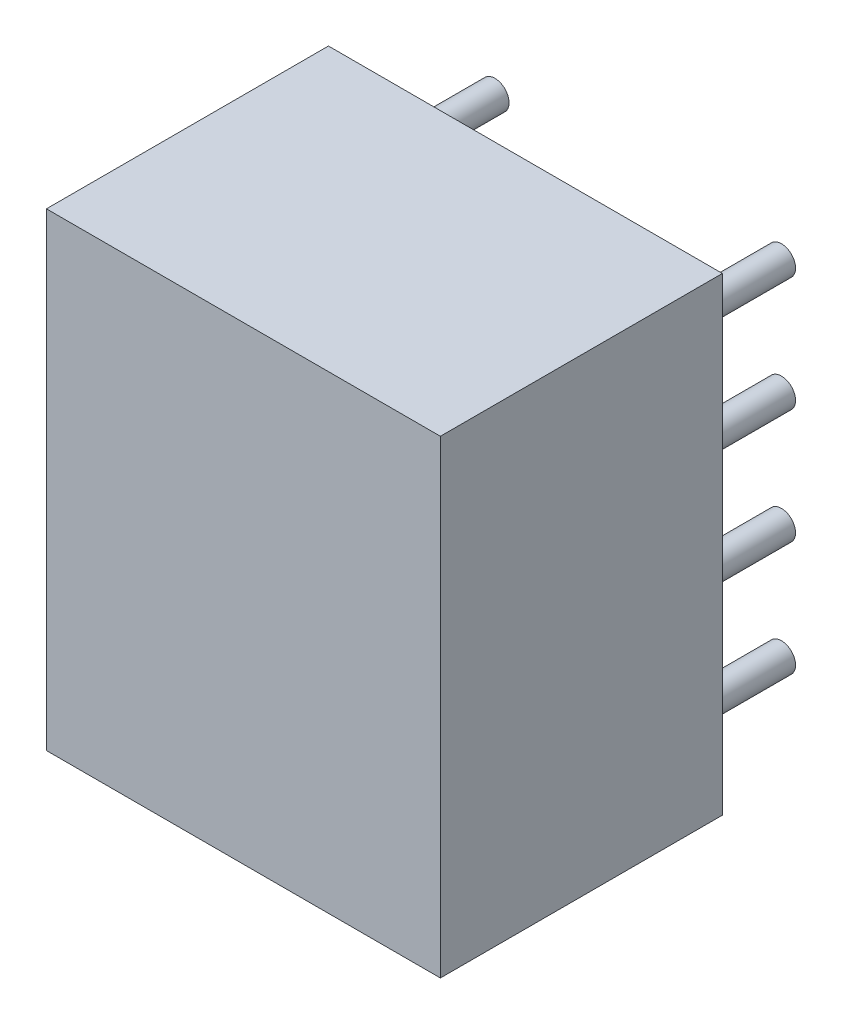
ISO-10303-21;
HEADER;
FILE_DESCRIPTION(('STEP AP214'),'2;1');
FILE_NAME('part.step','',(''),(''),'','','');
FILE_SCHEMA(('AUTOMOTIVE_DESIGN { 1 0 10303 214 1 1 1 1 }'));
ENDSEC;
DATA;
#1=APPLICATION_CONTEXT('core data for automotive mechanical design processes');
#2=APPLICATION_PROTOCOL_DEFINITION('international standard','automotive_design',2000,#1);
#3=PRODUCT_CONTEXT('',#1,'mechanical');
#4=PRODUCT('Part','Part','',(#3));
#5=PRODUCT_RELATED_PRODUCT_CATEGORY('part','',(#4));
#6=PRODUCT_DEFINITION_FORMATION('','',#4);
#7=PRODUCT_DEFINITION_CONTEXT('part definition',#1,'design');
#8=PRODUCT_DEFINITION('design','',#6,#7);
#9=PRODUCT_DEFINITION_SHAPE('','',#8);
#10=(LENGTH_UNIT() NAMED_UNIT(*) SI_UNIT(.MILLI.,.METRE.));
#11=(NAMED_UNIT(*) PLANE_ANGLE_UNIT() SI_UNIT($,.RADIAN.));
#12=(NAMED_UNIT(*) SI_UNIT($,.STERADIAN.) SOLID_ANGLE_UNIT());
#13=UNCERTAINTY_MEASURE_WITH_UNIT(LENGTH_MEASURE(1.E-05),#10,'distance_accuracy_value','');
#14=(GEOMETRIC_REPRESENTATION_CONTEXT(3) GLOBAL_UNCERTAINTY_ASSIGNED_CONTEXT((#13)) GLOBAL_UNIT_ASSIGNED_CONTEXT((#10,
#11,#12)) REPRESENTATION_CONTEXT('',''));
#15=CARTESIAN_POINT('',(0.,0.,0.));
#16=DIRECTION('',(0.,0.,1.));
#17=DIRECTION('',(1.,0.,0.));
#18=AXIS2_PLACEMENT_3D('',#15,#16,#17);
#19=CARTESIAN_POINT('',(0.,6.096,-2.));
#20=DIRECTION('',(0.,0.,1.));
#21=DIRECTION('',(1.,0.,0.));
#22=AXIS2_PLACEMENT_3D('',#19,#20,#21);
#23=CYLINDRICAL_SURFACE('',#22,0.25);
#24=CARTESIAN_POINT('',(0.,6.096,-2.));
#25=DIRECTION('',(0.,0.,1.));
#26=DIRECTION('',(1.,0.,0.));
#27=AXIS2_PLACEMENT_3D('',#24,#25,#26);
#28=CIRCLE('',#27,0.25);
#29=CARTESIAN_POINT('',(0.25,6.096,-2.));
#30=VERTEX_POINT('',#29);
#31=EDGE_CURVE('E11',#30,#30,#28,.T.);
#32=ORIENTED_EDGE('',*,*,#31,.T.);
#33=EDGE_LOOP('',(#32));
#34=FACE_BOUND('',#33,.T.);
#35=CARTESIAN_POINT('',(0.,6.096,0.));
#36=DIRECTION('',(0.,0.,1.));
#37=DIRECTION('',(1.,0.,0.));
#38=AXIS2_PLACEMENT_3D('',#35,#36,#37);
#39=CIRCLE('',#38,0.25);
#40=CARTESIAN_POINT('',(0.25,6.096,0.));
#41=VERTEX_POINT('',#40);
#42=EDGE_CURVE('E43',#41,#41,#39,.T.);
#43=ORIENTED_EDGE('',*,*,#42,.F.);
#44=EDGE_LOOP('',(#43));
#45=FACE_BOUND('',#44,.T.);
#46=ADVANCED_FACE('F40',(#34,#45),#23,.T.);
#47=CARTESIAN_POINT('',(0.,6.096,-2.));
#48=DIRECTION('',(0.,0.,1.));
#49=DIRECTION('',(1.,0.,0.));
#50=AXIS2_PLACEMENT_3D('',#47,#48,#49);
#51=PLANE('',#50);
#52=ORIENTED_EDGE('',*,*,#31,.F.);
#53=EDGE_LOOP('',(#52));
#54=FACE_BOUND('',#53,.T.);
#55=ADVANCED_FACE('F55',(#54),#51,.F.);
#56=CARTESIAN_POINT('',(0.,6.096,0.));
#57=DIRECTION('',(0.,0.,1.));
#58=DIRECTION('',(1.,0.,0.));
#59=AXIS2_PLACEMENT_3D('',#56,#57,#58);
#60=PLANE('',#59);
#61=ORIENTED_EDGE('',*,*,#42,.T.);
#62=EDGE_LOOP('',(#61));
#63=FACE_BOUND('',#62,.T.);
#64=ADVANCED_FACE('F52',(#63),#60,.T.);
#65=CLOSED_SHELL('',(#46,#55,#64));
#66=MANIFOLD_SOLID_BREP('B2',#65);
#67=CARTESIAN_POINT('',(0.,4.064,-2.));
#68=DIRECTION('',(0.,0.,1.));
#69=DIRECTION('',(1.,0.,0.));
#70=AXIS2_PLACEMENT_3D('',#67,#68,#69);
#71=CYLINDRICAL_SURFACE('',#70,0.25);
#72=CARTESIAN_POINT('',(0.,4.064,-2.));
#73=DIRECTION('',(0.,0.,1.));
#74=DIRECTION('',(1.,0.,0.));
#75=AXIS2_PLACEMENT_3D('',#72,#73,#74);
#76=CIRCLE('',#75,0.25);
#77=CARTESIAN_POINT('',(0.25,4.064,-2.));
#78=VERTEX_POINT('',#77);
#79=EDGE_CURVE('E39',#78,#78,#76,.T.);
#80=ORIENTED_EDGE('',*,*,#79,.T.);
#81=EDGE_LOOP('',(#80));
#82=FACE_BOUND('',#81,.T.);
#83=CARTESIAN_POINT('',(0.,4.064,0.));
#84=DIRECTION('',(0.,0.,1.));
#85=DIRECTION('',(1.,0.,0.));
#86=AXIS2_PLACEMENT_3D('',#83,#84,#85);
#87=CIRCLE('',#86,0.25);
#88=CARTESIAN_POINT('',(0.25,4.064,0.));
#89=VERTEX_POINT('',#88);
#90=EDGE_CURVE('E92',#89,#89,#87,.T.);
#91=ORIENTED_EDGE('',*,*,#90,.F.);
#92=EDGE_LOOP('',(#91));
#93=FACE_BOUND('',#92,.T.);
#94=ADVANCED_FACE('F89',(#82,#93),#71,.T.);
#95=CARTESIAN_POINT('',(0.,4.064,-2.));
#96=DIRECTION('',(0.,0.,1.));
#97=DIRECTION('',(1.,0.,0.));
#98=AXIS2_PLACEMENT_3D('',#95,#96,#97);
#99=PLANE('',#98);
#100=ORIENTED_EDGE('',*,*,#79,.F.);
#101=EDGE_LOOP('',(#100));
#102=FACE_BOUND('',#101,.T.);
#103=ADVANCED_FACE('F104',(#102),#99,.F.);
#104=CARTESIAN_POINT('',(0.,4.064,0.));
#105=DIRECTION('',(0.,0.,1.));
#106=DIRECTION('',(1.,0.,0.));
#107=AXIS2_PLACEMENT_3D('',#104,#105,#106);
#108=PLANE('',#107);
#109=ORIENTED_EDGE('',*,*,#90,.T.);
#110=EDGE_LOOP('',(#109));
#111=FACE_BOUND('',#110,.T.);
#112=ADVANCED_FACE('F101',(#111),#108,.T.);
#113=CLOSED_SHELL('',(#94,#103,#112));
#114=MANIFOLD_SOLID_BREP('B6',#113);
#115=CARTESIAN_POINT('',(0.,2.032,-2.));
#116=DIRECTION('',(0.,0.,1.));
#117=DIRECTION('',(1.,0.,0.));
#118=AXIS2_PLACEMENT_3D('',#115,#116,#117);
#119=CYLINDRICAL_SURFACE('',#118,0.25);
#120=CARTESIAN_POINT('',(0.,2.032,-2.));
#121=DIRECTION('',(0.,0.,1.));
#122=DIRECTION('',(1.,0.,0.));
#123=AXIS2_PLACEMENT_3D('',#120,#121,#122);
#124=CIRCLE('',#123,0.25);
#125=CARTESIAN_POINT('',(0.25,2.032,-2.));
#126=VERTEX_POINT('',#125);
#127=EDGE_CURVE('E88',#126,#126,#124,.T.);
#128=ORIENTED_EDGE('',*,*,#127,.T.);
#129=EDGE_LOOP('',(#128));
#130=FACE_BOUND('',#129,.T.);
#131=CARTESIAN_POINT('',(0.,2.032,0.));
#132=DIRECTION('',(0.,0.,1.));
#133=DIRECTION('',(1.,0.,0.));
#134=AXIS2_PLACEMENT_3D('',#131,#132,#133);
#135=CIRCLE('',#134,0.25);
#136=CARTESIAN_POINT('',(0.25,2.032,0.));
#137=VERTEX_POINT('',#136);
#138=EDGE_CURVE('E141',#137,#137,#135,.T.);
#139=ORIENTED_EDGE('',*,*,#138,.F.);
#140=EDGE_LOOP('',(#139));
#141=FACE_BOUND('',#140,.T.);
#142=ADVANCED_FACE('F138',(#130,#141),#119,.T.);
#143=CARTESIAN_POINT('',(0.,2.032,-2.));
#144=DIRECTION('',(0.,0.,1.));
#145=DIRECTION('',(1.,0.,0.));
#146=AXIS2_PLACEMENT_3D('',#143,#144,#145);
#147=PLANE('',#146);
#148=ORIENTED_EDGE('',*,*,#127,.F.);
#149=EDGE_LOOP('',(#148));
#150=FACE_BOUND('',#149,.T.);
#151=ADVANCED_FACE('F153',(#150),#147,.F.);
#152=CARTESIAN_POINT('',(0.,2.032,0.));
#153=DIRECTION('',(0.,0.,1.));
#154=DIRECTION('',(1.,0.,0.));
#155=AXIS2_PLACEMENT_3D('',#152,#153,#154);
#156=PLANE('',#155);
#157=ORIENTED_EDGE('',*,*,#138,.T.);
#158=EDGE_LOOP('',(#157));
#159=FACE_BOUND('',#158,.T.);
#160=ADVANCED_FACE('F150',(#159),#156,.T.);
#161=CLOSED_SHELL('',(#142,#151,#160));
#162=MANIFOLD_SOLID_BREP('B34',#161);
#163=CARTESIAN_POINT('',(0.,0.,-2.));
#164=DIRECTION('',(0.,0.,1.));
#165=DIRECTION('',(1.,0.,0.));
#166=AXIS2_PLACEMENT_3D('',#163,#164,#165);
#167=CYLINDRICAL_SURFACE('',#166,0.25);
#168=CARTESIAN_POINT('',(0.,0.,-2.));
#169=DIRECTION('',(0.,0.,1.));
#170=DIRECTION('',(1.,0.,0.));
#171=AXIS2_PLACEMENT_3D('',#168,#169,#170);
#172=CIRCLE('',#171,0.25);
#173=CARTESIAN_POINT('',(0.25,0.,-2.));
#174=VERTEX_POINT('',#173);
#175=EDGE_CURVE('E137',#174,#174,#172,.T.);
#176=ORIENTED_EDGE('',*,*,#175,.T.);
#177=EDGE_LOOP('',(#176));
#178=FACE_BOUND('',#177,.T.);
#179=CARTESIAN_POINT('',(0.,0.,0.));
#180=DIRECTION('',(0.,0.,1.));
#181=DIRECTION('',(1.,0.,0.));
#182=AXIS2_PLACEMENT_3D('',#179,#180,#181);
#183=CIRCLE('',#182,0.25);
#184=CARTESIAN_POINT('',(0.25,0.,0.));
#185=VERTEX_POINT('',#184);
#186=EDGE_CURVE('E190',#185,#185,#183,.T.);
#187=ORIENTED_EDGE('',*,*,#186,.F.);
#188=EDGE_LOOP('',(#187));
#189=FACE_BOUND('',#188,.T.);
#190=ADVANCED_FACE('F187',(#178,#189),#167,.T.);
#191=CARTESIAN_POINT('',(0.,0.,-2.));
#192=DIRECTION('',(0.,0.,1.));
#193=DIRECTION('',(1.,0.,0.));
#194=AXIS2_PLACEMENT_3D('',#191,#192,#193);
#195=PLANE('',#194);
#196=ORIENTED_EDGE('',*,*,#175,.F.);
#197=EDGE_LOOP('',(#196));
#198=FACE_BOUND('',#197,.T.);
#199=ADVANCED_FACE('F202',(#198),#195,.F.);
#200=CARTESIAN_POINT('',(0.,0.,0.));
#201=DIRECTION('',(0.,0.,1.));
#202=DIRECTION('',(1.,0.,0.));
#203=AXIS2_PLACEMENT_3D('',#200,#201,#202);
#204=PLANE('',#203);
#205=ORIENTED_EDGE('',*,*,#186,.T.);
#206=EDGE_LOOP('',(#205));
#207=FACE_BOUND('',#206,.T.);
#208=ADVANCED_FACE('F199',(#207),#204,.T.);
#209=CLOSED_SHELL('',(#190,#199,#208));
#210=MANIFOLD_SOLID_BREP('B83',#209);
#211=CARTESIAN_POINT('',(5.08,6.096,-2.));
#212=DIRECTION('',(0.,0.,1.));
#213=DIRECTION('',(1.,0.,0.));
#214=AXIS2_PLACEMENT_3D('',#211,#212,#213);
#215=CYLINDRICAL_SURFACE('',#214,0.25);
#216=CARTESIAN_POINT('',(5.08,6.096,-2.));
#217=DIRECTION('',(0.,0.,1.));
#218=DIRECTION('',(1.,0.,0.));
#219=AXIS2_PLACEMENT_3D('',#216,#217,#218);
#220=CIRCLE('',#219,0.25);
#221=CARTESIAN_POINT('',(5.33,6.096,-2.));
#222=VERTEX_POINT('',#221);
#223=EDGE_CURVE('E186',#222,#222,#220,.T.);
#224=ORIENTED_EDGE('',*,*,#223,.T.);
#225=EDGE_LOOP('',(#224));
#226=FACE_BOUND('',#225,.T.);
#227=CARTESIAN_POINT('',(5.08,6.096,0.));
#228=DIRECTION('',(0.,0.,1.));
#229=DIRECTION('',(1.,0.,0.));
#230=AXIS2_PLACEMENT_3D('',#227,#228,#229);
#231=CIRCLE('',#230,0.25);
#232=CARTESIAN_POINT('',(5.33,6.096,0.));
#233=VERTEX_POINT('',#232);
#234=EDGE_CURVE('E239',#233,#233,#231,.T.);
#235=ORIENTED_EDGE('',*,*,#234,.F.);
#236=EDGE_LOOP('',(#235));
#237=FACE_BOUND('',#236,.T.);
#238=ADVANCED_FACE('F236',(#226,#237),#215,.T.);
#239=CARTESIAN_POINT('',(5.08,6.096,-2.));
#240=DIRECTION('',(0.,0.,1.));
#241=DIRECTION('',(1.,0.,0.));
#242=AXIS2_PLACEMENT_3D('',#239,#240,#241);
#243=PLANE('',#242);
#244=ORIENTED_EDGE('',*,*,#223,.F.);
#245=EDGE_LOOP('',(#244));
#246=FACE_BOUND('',#245,.T.);
#247=ADVANCED_FACE('F251',(#246),#243,.F.);
#248=CARTESIAN_POINT('',(5.08,6.096,0.));
#249=DIRECTION('',(0.,0.,1.));
#250=DIRECTION('',(1.,0.,0.));
#251=AXIS2_PLACEMENT_3D('',#248,#249,#250);
#252=PLANE('',#251);
#253=ORIENTED_EDGE('',*,*,#234,.T.);
#254=EDGE_LOOP('',(#253));
#255=FACE_BOUND('',#254,.T.);
#256=ADVANCED_FACE('F248',(#255),#252,.T.);
#257=CLOSED_SHELL('',(#238,#247,#256));
#258=MANIFOLD_SOLID_BREP('B132',#257);
#259=CARTESIAN_POINT('',(5.08,4.064,-2.));
#260=DIRECTION('',(0.,0.,1.));
#261=DIRECTION('',(1.,0.,0.));
#262=AXIS2_PLACEMENT_3D('',#259,#260,#261);
#263=CYLINDRICAL_SURFACE('',#262,0.25);
#264=CARTESIAN_POINT('',(5.08,4.064,-2.));
#265=DIRECTION('',(0.,0.,1.));
#266=DIRECTION('',(1.,0.,0.));
#267=AXIS2_PLACEMENT_3D('',#264,#265,#266);
#268=CIRCLE('',#267,0.25);
#269=CARTESIAN_POINT('',(5.33,4.064,-2.));
#270=VERTEX_POINT('',#269);
#271=EDGE_CURVE('E235',#270,#270,#268,.T.);
#272=ORIENTED_EDGE('',*,*,#271,.T.);
#273=EDGE_LOOP('',(#272));
#274=FACE_BOUND('',#273,.T.);
#275=CARTESIAN_POINT('',(5.08,4.064,0.));
#276=DIRECTION('',(0.,0.,1.));
#277=DIRECTION('',(1.,0.,0.));
#278=AXIS2_PLACEMENT_3D('',#275,#276,#277);
#279=CIRCLE('',#278,0.25);
#280=CARTESIAN_POINT('',(5.33,4.064,0.));
#281=VERTEX_POINT('',#280);
#282=EDGE_CURVE('E288',#281,#281,#279,.T.);
#283=ORIENTED_EDGE('',*,*,#282,.F.);
#284=EDGE_LOOP('',(#283));
#285=FACE_BOUND('',#284,.T.);
#286=ADVANCED_FACE('F285',(#274,#285),#263,.T.);
#287=CARTESIAN_POINT('',(5.08,4.064,-2.));
#288=DIRECTION('',(0.,0.,1.));
#289=DIRECTION('',(1.,0.,0.));
#290=AXIS2_PLACEMENT_3D('',#287,#288,#289);
#291=PLANE('',#290);
#292=ORIENTED_EDGE('',*,*,#271,.F.);
#293=EDGE_LOOP('',(#292));
#294=FACE_BOUND('',#293,.T.);
#295=ADVANCED_FACE('F300',(#294),#291,.F.);
#296=CARTESIAN_POINT('',(5.08,4.064,0.));
#297=DIRECTION('',(0.,0.,1.));
#298=DIRECTION('',(1.,0.,0.));
#299=AXIS2_PLACEMENT_3D('',#296,#297,#298);
#300=PLANE('',#299);
#301=ORIENTED_EDGE('',*,*,#282,.T.);
#302=EDGE_LOOP('',(#301));
#303=FACE_BOUND('',#302,.T.);
#304=ADVANCED_FACE('F297',(#303),#300,.T.);
#305=CLOSED_SHELL('',(#286,#295,#304));
#306=MANIFOLD_SOLID_BREP('B181',#305);
#307=CARTESIAN_POINT('',(5.08,2.032,-2.));
#308=DIRECTION('',(0.,0.,1.));
#309=DIRECTION('',(1.,0.,0.));
#310=AXIS2_PLACEMENT_3D('',#307,#308,#309);
#311=CYLINDRICAL_SURFACE('',#310,0.25);
#312=CARTESIAN_POINT('',(5.08,2.032,-2.));
#313=DIRECTION('',(0.,0.,1.));
#314=DIRECTION('',(1.,0.,0.));
#315=AXIS2_PLACEMENT_3D('',#312,#313,#314);
#316=CIRCLE('',#315,0.25);
#317=CARTESIAN_POINT('',(5.33,2.032,-2.));
#318=VERTEX_POINT('',#317);
#319=EDGE_CURVE('E284',#318,#318,#316,.T.);
#320=ORIENTED_EDGE('',*,*,#319,.T.);
#321=EDGE_LOOP('',(#320));
#322=FACE_BOUND('',#321,.T.);
#323=CARTESIAN_POINT('',(5.08,2.032,0.));
#324=DIRECTION('',(0.,0.,1.));
#325=DIRECTION('',(1.,0.,0.));
#326=AXIS2_PLACEMENT_3D('',#323,#324,#325);
#327=CIRCLE('',#326,0.25);
#328=CARTESIAN_POINT('',(5.33,2.032,0.));
#329=VERTEX_POINT('',#328);
#330=EDGE_CURVE('E337',#329,#329,#327,.T.);
#331=ORIENTED_EDGE('',*,*,#330,.F.);
#332=EDGE_LOOP('',(#331));
#333=FACE_BOUND('',#332,.T.);
#334=ADVANCED_FACE('F334',(#322,#333),#311,.T.);
#335=CARTESIAN_POINT('',(5.08,2.032,-2.));
#336=DIRECTION('',(0.,0.,1.));
#337=DIRECTION('',(1.,0.,0.));
#338=AXIS2_PLACEMENT_3D('',#335,#336,#337);
#339=PLANE('',#338);
#340=ORIENTED_EDGE('',*,*,#319,.F.);
#341=EDGE_LOOP('',(#340));
#342=FACE_BOUND('',#341,.T.);
#343=ADVANCED_FACE('F349',(#342),#339,.F.);
#344=CARTESIAN_POINT('',(5.08,2.032,0.));
#345=DIRECTION('',(0.,0.,1.));
#346=DIRECTION('',(1.,0.,0.));
#347=AXIS2_PLACEMENT_3D('',#344,#345,#346);
#348=PLANE('',#347);
#349=ORIENTED_EDGE('',*,*,#330,.T.);
#350=EDGE_LOOP('',(#349));
#351=FACE_BOUND('',#350,.T.);
#352=ADVANCED_FACE('F346',(#351),#348,.T.);
#353=CLOSED_SHELL('',(#334,#343,#352));
#354=MANIFOLD_SOLID_BREP('B230',#353);
#355=CARTESIAN_POINT('',(5.08,0.,-2.));
#356=DIRECTION('',(0.,0.,1.));
#357=DIRECTION('',(1.,0.,0.));
#358=AXIS2_PLACEMENT_3D('',#355,#356,#357);
#359=CYLINDRICAL_SURFACE('',#358,0.25);
#360=CARTESIAN_POINT('',(5.08,0.,-2.));
#361=DIRECTION('',(0.,0.,1.));
#362=DIRECTION('',(1.,0.,0.));
#363=AXIS2_PLACEMENT_3D('',#360,#361,#362);
#364=CIRCLE('',#363,0.25);
#365=CARTESIAN_POINT('',(5.33,0.,-2.));
#366=VERTEX_POINT('',#365);
#367=EDGE_CURVE('E333',#366,#366,#364,.T.);
#368=ORIENTED_EDGE('',*,*,#367,.T.);
#369=EDGE_LOOP('',(#368));
#370=FACE_BOUND('',#369,.T.);
#371=CARTESIAN_POINT('',(5.08,0.,0.));
#372=DIRECTION('',(0.,0.,1.));
#373=DIRECTION('',(1.,0.,0.));
#374=AXIS2_PLACEMENT_3D('',#371,#372,#373);
#375=CIRCLE('',#374,0.25);
#376=CARTESIAN_POINT('',(5.33,0.,0.));
#377=VERTEX_POINT('',#376);
#378=EDGE_CURVE('E387',#377,#377,#375,.T.);
#379=ORIENTED_EDGE('',*,*,#378,.F.);
#380=EDGE_LOOP('',(#379));
#381=FACE_BOUND('',#380,.T.);
#382=ADVANCED_FACE('F384',(#370,#381),#359,.T.);
#383=CARTESIAN_POINT('',(5.08,0.,-2.));
#384=DIRECTION('',(0.,0.,1.));
#385=DIRECTION('',(1.,0.,0.));
#386=AXIS2_PLACEMENT_3D('',#383,#384,#385);
#387=PLANE('',#386);
#388=ORIENTED_EDGE('',*,*,#367,.F.);
#389=EDGE_LOOP('',(#388));
#390=FACE_BOUND('',#389,.T.);
#391=ADVANCED_FACE('F399',(#390),#387,.F.);
#392=CARTESIAN_POINT('',(5.08,0.,0.));
#393=DIRECTION('',(0.,0.,1.));
#394=DIRECTION('',(1.,0.,0.));
#395=AXIS2_PLACEMENT_3D('',#392,#393,#394);
#396=PLANE('',#395);
#397=ORIENTED_EDGE('',*,*,#378,.T.);
#398=EDGE_LOOP('',(#397));
#399=FACE_BOUND('',#398,.T.);
#400=ADVANCED_FACE('F396',(#399),#396,.T.);
#401=CLOSED_SHELL('',(#382,#391,#400));
#402=MANIFOLD_SOLID_BREP('B279',#401);
#403=CARTESIAN_POINT('',(6.0325,7.366,5.));
#404=DIRECTION('',(0.,-1.,0.));
#405=DIRECTION('',(0.,0.,-1.));
#406=AXIS2_PLACEMENT_3D('',#403,#404,#405);
#407=PLANE('',#406);
#408=DIRECTION('',(-1.,0.,0.));
#409=VECTOR('',#408,1.);
#410=CARTESIAN_POINT('',(6.0325,7.366,0.));
#411=LINE('',#410,#409);
#412=CARTESIAN_POINT('',(6.0325,7.366,0.));
#413=VERTEX_POINT('',#412);
#414=CARTESIAN_POINT('',(-0.9525,7.366,0.));
#415=VERTEX_POINT('',#414);
#416=EDGE_CURVE('E488',#413,#415,#411,.T.);
#417=ORIENTED_EDGE('',*,*,#416,.T.);
#418=DIRECTION('',(0.,0.,-1.));
#419=VECTOR('',#418,1.);
#420=CARTESIAN_POINT('',(-0.9525,7.366,5.));
#421=LINE('',#420,#419);
#422=CARTESIAN_POINT('',(-0.9525,7.366,5.));
#423=VERTEX_POINT('',#422);
#424=EDGE_CURVE('E382',#423,#415,#421,.T.);
#425=ORIENTED_EDGE('',*,*,#424,.F.);
#426=DIRECTION('',(-1.,0.,0.));
#427=VECTOR('',#426,1.);
#428=CARTESIAN_POINT('',(6.0325,7.366,5.));
#429=LINE('',#428,#427);
#430=CARTESIAN_POINT('',(6.0325,7.366,5.));
#431=VERTEX_POINT('',#430);
#432=EDGE_CURVE('E476',#431,#423,#429,.T.);
#433=ORIENTED_EDGE('',*,*,#432,.F.);
#434=DIRECTION('',(0.,0.,-1.));
#435=VECTOR('',#434,1.);
#436=CARTESIAN_POINT('',(6.0325,7.366,5.));
#437=LINE('',#436,#435);
#438=EDGE_CURVE('E484',#431,#413,#437,.T.);
#439=ORIENTED_EDGE('',*,*,#438,.T.);
#440=EDGE_LOOP('',(#417,#425,#433,#439));
#441=FACE_BOUND('',#440,.T.);
#442=ADVANCED_FACE('F425',(#441),#407,.F.);
#443=CARTESIAN_POINT('',(-0.9525,7.366,5.));
#444=DIRECTION('',(1.,0.,0.));
#445=DIRECTION('',(0.,0.,-1.));
#446=AXIS2_PLACEMENT_3D('',#443,#444,#445);
#447=PLANE('',#446);
#448=DIRECTION('',(0.,-1.,0.));
#449=VECTOR('',#448,1.);
#450=CARTESIAN_POINT('',(-0.9525,7.366,0.));
#451=LINE('',#450,#449);
#452=CARTESIAN_POINT('',(-0.9525,-0.9525,0.));
#453=VERTEX_POINT('',#452);
#454=EDGE_CURVE('E480',#415,#453,#451,.T.);
#455=ORIENTED_EDGE('',*,*,#454,.T.);
#456=DIRECTION('',(0.,0.,-1.));
#457=VECTOR('',#456,1.);
#458=CARTESIAN_POINT('',(-0.9525,-0.9525,5.));
#459=LINE('',#458,#457);
#460=CARTESIAN_POINT('',(-0.9525,-0.9525,5.));
#461=VERTEX_POINT('',#460);
#462=EDGE_CURVE('E433',#461,#453,#459,.T.);
#463=ORIENTED_EDGE('',*,*,#462,.F.);
#464=DIRECTION('',(0.,-1.,0.));
#465=VECTOR('',#464,1.);
#466=CARTESIAN_POINT('',(-0.9525,7.366,5.));
#467=LINE('',#466,#465);
#468=EDGE_CURVE('E471',#423,#461,#467,.T.);
#469=ORIENTED_EDGE('',*,*,#468,.F.);
#470=ORIENTED_EDGE('',*,*,#424,.T.);
#471=EDGE_LOOP('',(#455,#463,#469,#470));
#472=FACE_BOUND('',#471,.T.);
#473=ADVANCED_FACE('F479',(#472),#447,.F.);
#474=CARTESIAN_POINT('',(-0.9525,-0.9525,5.));
#475=DIRECTION('',(0.,1.,0.));
#476=DIRECTION('',(0.,0.,1.));
#477=AXIS2_PLACEMENT_3D('',#474,#475,#476);
#478=PLANE('',#477);
#479=DIRECTION('',(1.,0.,0.));
#480=VECTOR('',#479,1.);
#481=CARTESIAN_POINT('',(-0.9525,-0.9525,0.));
#482=LINE('',#481,#480);
#483=CARTESIAN_POINT('',(6.0325,-0.9525,0.));
#484=VERTEX_POINT('',#483);
#485=EDGE_CURVE('E458',#453,#484,#482,.T.);
#486=ORIENTED_EDGE('',*,*,#485,.T.);
#487=DIRECTION('',(0.,0.,-1.));
#488=VECTOR('',#487,1.);
#489=CARTESIAN_POINT('',(6.0325,-0.9525,5.));
#490=LINE('',#489,#488);
#491=CARTESIAN_POINT('',(6.0325,-0.9525,5.));
#492=VERTEX_POINT('',#491);
#493=EDGE_CURVE('E481',#492,#484,#490,.T.);
#494=ORIENTED_EDGE('',*,*,#493,.F.);
#495=DIRECTION('',(1.,0.,0.));
#496=VECTOR('',#495,1.);
#497=CARTESIAN_POINT('',(-0.9525,-0.9525,5.));
#498=LINE('',#497,#496);
#499=EDGE_CURVE('E474',#461,#492,#498,.T.);
#500=ORIENTED_EDGE('',*,*,#499,.F.);
#501=ORIENTED_EDGE('',*,*,#462,.T.);
#502=EDGE_LOOP('',(#486,#494,#500,#501));
#503=FACE_BOUND('',#502,.T.);
#504=ADVANCED_FACE('F482',(#503),#478,.F.);
#505=CARTESIAN_POINT('',(6.0325,-0.9525,5.));
#506=DIRECTION('',(-1.,0.,0.));
#507=DIRECTION('',(0.,0.,1.));
#508=AXIS2_PLACEMENT_3D('',#505,#506,#507);
#509=PLANE('',#508);
#510=DIRECTION('',(0.,1.,0.));
#511=VECTOR('',#510,1.);
#512=CARTESIAN_POINT('',(6.0325,-0.9525,0.));
#513=LINE('',#512,#511);
#514=EDGE_CURVE('E464',#484,#413,#513,.T.);
#515=ORIENTED_EDGE('',*,*,#514,.T.);
#516=ORIENTED_EDGE('',*,*,#438,.F.);
#517=DIRECTION('',(0.,1.,0.));
#518=VECTOR('',#517,1.);
#519=CARTESIAN_POINT('',(6.0325,-0.9525,5.));
#520=LINE('',#519,#518);
#521=EDGE_CURVE('E441',#492,#431,#520,.T.);
#522=ORIENTED_EDGE('',*,*,#521,.F.);
#523=ORIENTED_EDGE('',*,*,#493,.T.);
#524=EDGE_LOOP('',(#515,#516,#522,#523));
#525=FACE_BOUND('',#524,.T.);
#526=ADVANCED_FACE('F495',(#525),#509,.F.);
#527=CARTESIAN_POINT('',(0.,0.,5.));
#528=DIRECTION('',(0.,0.,1.));
#529=DIRECTION('',(1.,0.,0.));
#530=AXIS2_PLACEMENT_3D('',#527,#528,#529);
#531=PLANE('',#530);
#532=ORIENTED_EDGE('',*,*,#432,.T.);
#533=ORIENTED_EDGE('',*,*,#468,.T.);
#534=ORIENTED_EDGE('',*,*,#499,.T.);
#535=ORIENTED_EDGE('',*,*,#521,.T.);
#536=EDGE_LOOP('',(#532,#533,#534,#535));
#537=FACE_BOUND('',#536,.T.);
#538=ADVANCED_FACE('F472',(#537),#531,.T.);
#539=CARTESIAN_POINT('',(0.,0.,0.));
#540=DIRECTION('',(0.,0.,1.));
#541=DIRECTION('',(1.,0.,0.));
#542=AXIS2_PLACEMENT_3D('',#539,#540,#541);
#543=PLANE('',#542);
#544=ORIENTED_EDGE('',*,*,#416,.F.);
#545=ORIENTED_EDGE('',*,*,#514,.F.);
#546=ORIENTED_EDGE('',*,*,#485,.F.);
#547=ORIENTED_EDGE('',*,*,#454,.F.);
#548=EDGE_LOOP('',(#544,#545,#546,#547));
#549=FACE_BOUND('',#548,.T.);
#550=ADVANCED_FACE('F498',(#549),#543,.F.);
#551=CLOSED_SHELL('',(#442,#473,#504,#526,#538,#550));
#552=MANIFOLD_SOLID_BREP('B328',#551);
#553=ADVANCED_BREP_SHAPE_REPRESENTATION('',(#18,#66,#114,#162,#210,#258,#306,#354,#402,#552),#14);
#554=SHAPE_DEFINITION_REPRESENTATION(#9,#553);
ENDSEC;
END-ISO-10303-21;
